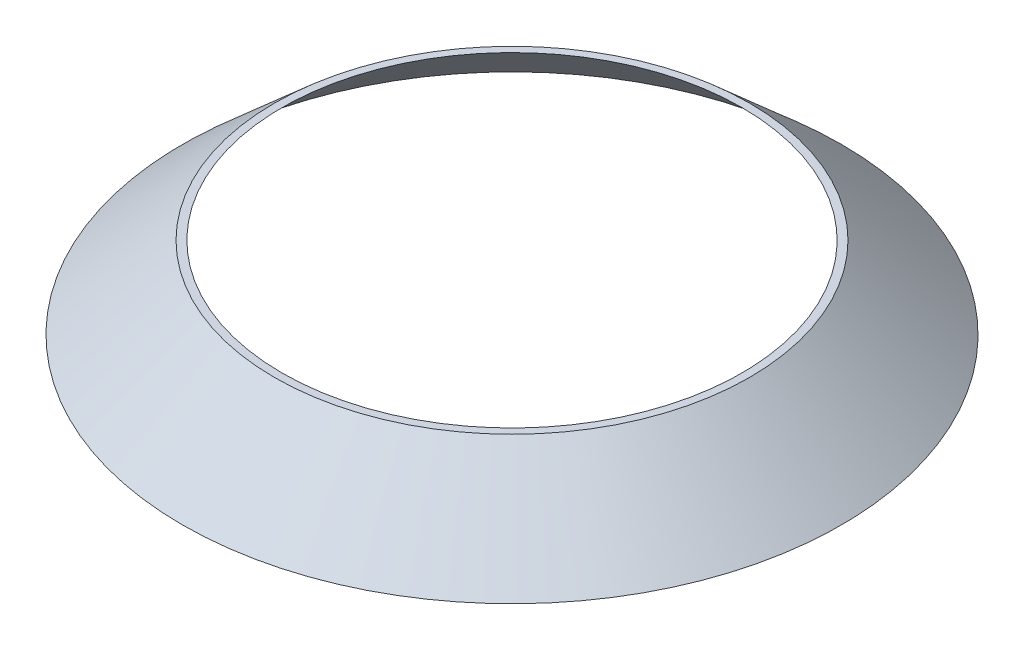
ISO-10303-21;
HEADER;
FILE_DESCRIPTION(('STEP AP214'),'2;1');
FILE_NAME('part.step','',(''),(''),'','','');
FILE_SCHEMA(('AUTOMOTIVE_DESIGN { 1 0 10303 214 1 1 1 1 }'));
ENDSEC;
DATA;
#1=APPLICATION_CONTEXT('core data for automotive mechanical design processes');
#2=APPLICATION_PROTOCOL_DEFINITION('international standard','automotive_design',2000,#1);
#3=PRODUCT_CONTEXT('',#1,'mechanical');
#4=PRODUCT('Part','Part','',(#3));
#5=PRODUCT_RELATED_PRODUCT_CATEGORY('part','',(#4));
#6=PRODUCT_DEFINITION_FORMATION('','',#4);
#7=PRODUCT_DEFINITION_CONTEXT('part definition',#1,'design');
#8=PRODUCT_DEFINITION('design','',#6,#7);
#9=PRODUCT_DEFINITION_SHAPE('','',#8);
#10=(LENGTH_UNIT() NAMED_UNIT(*) SI_UNIT(.MILLI.,.METRE.));
#11=(NAMED_UNIT(*) PLANE_ANGLE_UNIT() SI_UNIT($,.RADIAN.));
#12=(NAMED_UNIT(*) SI_UNIT($,.STERADIAN.) SOLID_ANGLE_UNIT());
#13=UNCERTAINTY_MEASURE_WITH_UNIT(LENGTH_MEASURE(1.E-05),#10,'distance_accuracy_value','');
#14=(GEOMETRIC_REPRESENTATION_CONTEXT(3) GLOBAL_UNCERTAINTY_ASSIGNED_CONTEXT((#13)) GLOBAL_UNIT_ASSIGNED_CONTEXT((#10,
#11,#12)) REPRESENTATION_CONTEXT('',''));
#15=CARTESIAN_POINT('',(0.,0.,0.));
#16=DIRECTION('',(0.,0.,1.));
#17=DIRECTION('',(1.,0.,0.));
#18=AXIS2_PLACEMENT_3D('',#15,#16,#17);
#19=CARTESIAN_POINT('',(0.,8.,0.));
#20=DIRECTION('',(0.,1.,0.));
#21=DIRECTION('',(0.,0.,1.));
#22=AXIS2_PLACEMENT_3D('',#19,#20,#21);
#23=PLANE('',#22);
#24=CARTESIAN_POINT('',(0.,8.,0.));
#25=DIRECTION('',(0.,1.,0.));
#26=DIRECTION('',(0.,0.,1.));
#27=AXIS2_PLACEMENT_3D('',#24,#25,#26);
#28=CIRCLE('',#27,22.5);
#29=CARTESIAN_POINT('',(0.,8.,22.5));
#30=VERTEX_POINT('',#29);
#31=EDGE_CURVE('E120',#30,#30,#28,.T.);
#32=ORIENTED_EDGE('',*,*,#31,.F.);
#33=EDGE_LOOP('',(#32));
#34=FACE_BOUND('',#33,.T.);
#35=CARTESIAN_POINT('',(0.,8.,0.));
#36=DIRECTION('',(0.,1.,0.));
#37=DIRECTION('',(0.,0.,1.));
#38=AXIS2_PLACEMENT_3D('',#35,#36,#37);
#39=CIRCLE('',#38,23.25);
#40=CARTESIAN_POINT('',(0.,8.,23.25));
#41=VERTEX_POINT('',#40);
#42=EDGE_CURVE('E11',#41,#41,#39,.T.);
#43=ORIENTED_EDGE('',*,*,#42,.T.);
#44=EDGE_LOOP('',(#43));
#45=FACE_BOUND('',#44,.T.);
#46=ADVANCED_FACE('F38',(#34,#45),#23,.T.);
#47=CARTESIAN_POINT('',(0.,0.,0.));
#48=DIRECTION('',(0.,1.,0.));
#49=DIRECTION('',(0.,0.,1.));
#50=AXIS2_PLACEMENT_3D('',#47,#48,#49);
#51=PLANE('',#50);
#52=CARTESIAN_POINT('',(0.,0.,0.));
#53=DIRECTION('',(0.,1.,0.));
#54=DIRECTION('',(0.,0.,1.));
#55=AXIS2_PLACEMENT_3D('',#52,#53,#54);
#56=CIRCLE('',#55,31.5);
#57=CARTESIAN_POINT('',(0.,0.,31.5));
#58=VERTEX_POINT('',#57);
#59=EDGE_CURVE('E53',#58,#58,#56,.T.);
#60=ORIENTED_EDGE('',*,*,#59,.T.);
#61=EDGE_LOOP('',(#60));
#62=FACE_BOUND('',#61,.T.);
#63=CARTESIAN_POINT('',(0.,0.,0.));
#64=DIRECTION('',(0.,1.,0.));
#65=DIRECTION('',(0.,0.,1.));
#66=AXIS2_PLACEMENT_3D('',#63,#64,#65);
#67=CIRCLE('',#66,32.25);
#68=CARTESIAN_POINT('',(0.,0.,32.25));
#69=VERTEX_POINT('',#68);
#70=EDGE_CURVE('E47',#69,#69,#67,.T.);
#71=ORIENTED_EDGE('',*,*,#70,.F.);
#72=EDGE_LOOP('',(#71));
#73=FACE_BOUND('',#72,.T.);
#74=ADVANCED_FACE('F69',(#62,#73),#51,.F.);
#75=CARTESIAN_POINT('',(0.,8.,0.));
#76=DIRECTION('',(0.,-1.,0.));
#77=DIRECTION('',(0.,0.,-1.));
#78=AXIS2_PLACEMENT_3D('',#75,#76,#77);
#79=CONICAL_SURFACE('',#78,23.25,0.844153986113171);
#80=ORIENTED_EDGE('',*,*,#70,.T.);
#81=EDGE_LOOP('',(#80));
#82=FACE_BOUND('',#81,.T.);
#83=ORIENTED_EDGE('',*,*,#42,.F.);
#84=EDGE_LOOP('',(#83));
#85=FACE_BOUND('',#84,.T.);
#86=ADVANCED_FACE('F78',(#82,#85),#79,.T.);
#87=CARTESIAN_POINT('',(0.,8.,0.));
#88=DIRECTION('',(0.,-1.,0.));
#89=DIRECTION('',(0.,0.,-1.));
#90=AXIS2_PLACEMENT_3D('',#87,#88,#89);
#91=CONICAL_SURFACE('',#90,22.5,0.844153986113171);
#92=ORIENTED_EDGE('',*,*,#31,.T.);
#93=EDGE_LOOP('',(#92));
#94=FACE_BOUND('',#93,.T.);
#95=ORIENTED_EDGE('',*,*,#59,.F.);
#96=EDGE_LOOP('',(#95));
#97=FACE_BOUND('',#96,.T.);
#98=ADVANCED_FACE('F79',(#94,#97),#91,.F.);
#99=CLOSED_SHELL('',(#46,#74,#86,#98));
#100=MANIFOLD_SOLID_BREP('B2',#99);
#101=ADVANCED_BREP_SHAPE_REPRESENTATION('',(#18,#100),#14);
#102=SHAPE_DEFINITION_REPRESENTATION(#9,#101);
ENDSEC;
END-ISO-10303-21;
